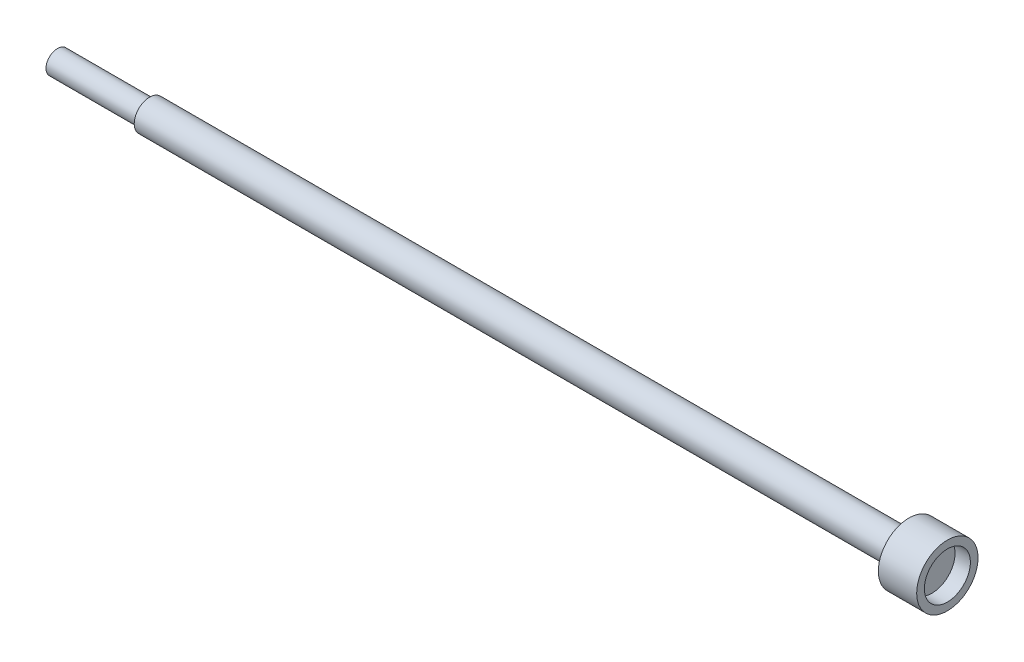
ISO-10303-21;
HEADER;
FILE_DESCRIPTION(('STEP AP214'),'2;1');
FILE_NAME('part.step','',(''),(''),'','','');
FILE_SCHEMA(('AUTOMOTIVE_DESIGN { 1 0 10303 214 1 1 1 1 }'));
ENDSEC;
DATA;
#1=APPLICATION_CONTEXT('core data for automotive mechanical design processes');
#2=APPLICATION_PROTOCOL_DEFINITION('international standard','automotive_design',2000,#1);
#3=PRODUCT_CONTEXT('',#1,'mechanical');
#4=PRODUCT('Part','Part','',(#3));
#5=PRODUCT_RELATED_PRODUCT_CATEGORY('part','',(#4));
#6=PRODUCT_DEFINITION_FORMATION('','',#4);
#7=PRODUCT_DEFINITION_CONTEXT('part definition',#1,'design');
#8=PRODUCT_DEFINITION('design','',#6,#7);
#9=PRODUCT_DEFINITION_SHAPE('','',#8);
#10=(LENGTH_UNIT() NAMED_UNIT(*) SI_UNIT(.MILLI.,.METRE.));
#11=(NAMED_UNIT(*) PLANE_ANGLE_UNIT() SI_UNIT($,.RADIAN.));
#12=(NAMED_UNIT(*) SI_UNIT($,.STERADIAN.) SOLID_ANGLE_UNIT());
#13=UNCERTAINTY_MEASURE_WITH_UNIT(LENGTH_MEASURE(1.E-05),#10,'distance_accuracy_value','');
#14=(GEOMETRIC_REPRESENTATION_CONTEXT(3) GLOBAL_UNCERTAINTY_ASSIGNED_CONTEXT((#13)) GLOBAL_UNIT_ASSIGNED_CONTEXT((#10,
#11,#12)) REPRESENTATION_CONTEXT('',''));
#15=CARTESIAN_POINT('',(0.,0.,0.));
#16=DIRECTION('',(0.,0.,1.));
#17=DIRECTION('',(1.,0.,0.));
#18=AXIS2_PLACEMENT_3D('',#15,#16,#17);
#19=CARTESIAN_POINT('',(0.,0.,0.));
#20=DIRECTION('',(1.,0.,0.));
#21=DIRECTION('',(0.,0.,-1.));
#22=AXIS2_PLACEMENT_3D('',#19,#20,#21);
#23=PLANE('',#22);
#24=CARTESIAN_POINT('',(0.,0.,0.));
#25=DIRECTION('',(-1.,0.,0.));
#26=DIRECTION('',(0.,0.,1.));
#27=AXIS2_PLACEMENT_3D('',#24,#25,#26);
#28=CIRCLE('',#27,19.05);
#29=CARTESIAN_POINT('',(0.,0.,19.05));
#30=VERTEX_POINT('',#29);
#31=EDGE_CURVE('E73',#30,#30,#28,.T.);
#32=ORIENTED_EDGE('',*,*,#31,.F.);
#33=EDGE_LOOP('',(#32));
#34=FACE_BOUND('',#33,.T.);
#35=ADVANCED_FACE('F41',(#34),#23,.T.);
#36=CARTESIAN_POINT('',(-723.9,0.,0.));
#37=DIRECTION('',(-1.,0.,0.));
#38=DIRECTION('',(0.,0.,1.));
#39=AXIS2_PLACEMENT_3D('',#36,#37,#38);
#40=CYLINDRICAL_SURFACE('',#39,19.05);
#41=ORIENTED_EDGE('',*,*,#31,.T.);
#42=EDGE_LOOP('',(#41));
#43=FACE_BOUND('',#42,.T.);
#44=CARTESIAN_POINT('',(12.7,0.,0.));
#45=DIRECTION('',(-1.,0.,0.));
#46=DIRECTION('',(0.,0.,1.));
#47=AXIS2_PLACEMENT_3D('',#44,#45,#46);
#48=CIRCLE('',#47,19.05);
#49=CARTESIAN_POINT('',(12.7,0.,19.05));
#50=VERTEX_POINT('',#49);
#51=EDGE_CURVE('E100',#50,#50,#48,.T.);
#52=ORIENTED_EDGE('',*,*,#51,.F.);
#53=EDGE_LOOP('',(#52));
#54=FACE_BOUND('',#53,.T.);
#55=ADVANCED_FACE('F107',(#43,#54),#40,.F.);
#56=CARTESIAN_POINT('',(12.7,0.,0.));
#57=DIRECTION('',(1.,0.,0.));
#58=DIRECTION('',(0.,0.,-1.));
#59=AXIS2_PLACEMENT_3D('',#56,#57,#58);
#60=PLANE('',#59);
#61=ORIENTED_EDGE('',*,*,#51,.T.);
#62=EDGE_LOOP('',(#61));
#63=FACE_BOUND('',#62,.T.);
#64=CARTESIAN_POINT('',(12.7,0.,0.));
#65=DIRECTION('',(-1.,0.,0.));
#66=DIRECTION('',(0.,0.,1.));
#67=AXIS2_PLACEMENT_3D('',#64,#65,#66);
#68=CIRCLE('',#67,25.4);
#69=CARTESIAN_POINT('',(12.7,0.,25.4));
#70=VERTEX_POINT('',#69);
#71=EDGE_CURVE('E97',#70,#70,#68,.T.);
#72=ORIENTED_EDGE('',*,*,#71,.F.);
#73=EDGE_LOOP('',(#72));
#74=FACE_BOUND('',#73,.T.);
#75=ADVANCED_FACE('F114',(#63,#74),#60,.T.);
#76=CARTESIAN_POINT('',(-723.9,0.,0.));
#77=DIRECTION('',(-1.,0.,0.));
#78=DIRECTION('',(0.,0.,1.));
#79=AXIS2_PLACEMENT_3D('',#76,#77,#78);
#80=CYLINDRICAL_SURFACE('',#79,25.4);
#81=ORIENTED_EDGE('',*,*,#71,.T.);
#82=EDGE_LOOP('',(#81));
#83=FACE_BOUND('',#82,.T.);
#84=CARTESIAN_POINT('',(-19.05,0.,0.));
#85=DIRECTION('',(-1.,0.,0.));
#86=DIRECTION('',(0.,0.,1.));
#87=AXIS2_PLACEMENT_3D('',#84,#85,#86);
#88=CIRCLE('',#87,25.4);
#89=CARTESIAN_POINT('',(-19.05,0.,25.4));
#90=VERTEX_POINT('',#89);
#91=EDGE_CURVE('E94',#90,#90,#88,.T.);
#92=ORIENTED_EDGE('',*,*,#91,.F.);
#93=EDGE_LOOP('',(#92));
#94=FACE_BOUND('',#93,.T.);
#95=ADVANCED_FACE('F118',(#83,#94),#80,.T.);
#96=CARTESIAN_POINT('',(-19.05,0.,0.));
#97=DIRECTION('',(-1.,0.,0.));
#98=DIRECTION('',(0.,0.,1.));
#99=AXIS2_PLACEMENT_3D('',#96,#97,#98);
#100=PLANE('',#99);
#101=ORIENTED_EDGE('',*,*,#91,.T.);
#102=EDGE_LOOP('',(#101));
#103=FACE_BOUND('',#102,.T.);
#104=CARTESIAN_POINT('',(-19.05,0.,0.));
#105=DIRECTION('',(-1.,0.,0.));
#106=DIRECTION('',(0.,0.,1.));
#107=AXIS2_PLACEMENT_3D('',#104,#105,#106);
#108=CIRCLE('',#107,12.7);
#109=CARTESIAN_POINT('',(-19.05,0.,12.7));
#110=VERTEX_POINT('',#109);
#111=EDGE_CURVE('E91',#110,#110,#108,.T.);
#112=ORIENTED_EDGE('',*,*,#111,.F.);
#113=EDGE_LOOP('',(#112));
#114=FACE_BOUND('',#113,.T.);
#115=ADVANCED_FACE('F124',(#103,#114),#100,.T.);
#116=CARTESIAN_POINT('',(-723.9,0.,0.));
#117=DIRECTION('',(-1.,0.,0.));
#118=DIRECTION('',(0.,0.,1.));
#119=AXIS2_PLACEMENT_3D('',#116,#117,#118);
#120=CYLINDRICAL_SURFACE('',#119,12.7);
#121=CARTESIAN_POINT('',(-424.18,0.,0.));
#122=DIRECTION('',(-1.,0.,0.));
#123=DIRECTION('',(0.,0.,1.));
#124=AXIS2_PLACEMENT_3D('',#121,#122,#123);
#125=CIRCLE('',#124,12.7);
#126=CARTESIAN_POINT('',(-424.18,-8.4002604126299,-9.52500000000016));
#127=VERTEX_POINT('',#126);
#128=CARTESIAN_POINT('',(-424.18,8.4002604126299,-9.52500000000016));
#129=VERTEX_POINT('',#128);
#130=EDGE_CURVE('E68',#127,#129,#125,.F.);
#131=ORIENTED_EDGE('',*,*,#130,.F.);
#132=DIRECTION('',(-1.,0.,0.));
#133=VECTOR('',#132,1.);
#134=CARTESIAN_POINT('',(-723.9,-8.4002604126299,-9.52500000000016));
#135=LINE('',#134,#133);
#136=CARTESIAN_POINT('',(-398.78,-8.4002604126299,-9.52500000000016));
#137=VERTEX_POINT('',#136);
#138=EDGE_CURVE('E11',#137,#127,#135,.T.);
#139=ORIENTED_EDGE('',*,*,#138,.F.);
#140=CARTESIAN_POINT('',(-398.78,0.,0.));
#141=DIRECTION('',(1.,0.,0.));
#142=DIRECTION('',(0.,0.,-1.));
#143=AXIS2_PLACEMENT_3D('',#140,#141,#142);
#144=CIRCLE('',#143,12.7);
#145=CARTESIAN_POINT('',(-398.78,8.4002604126299,-9.52500000000016));
#146=VERTEX_POINT('',#145);
#147=EDGE_CURVE('E48',#146,#137,#144,.F.);
#148=ORIENTED_EDGE('',*,*,#147,.F.);
#149=DIRECTION('',(-1.,0.,0.));
#150=VECTOR('',#149,1.);
#151=CARTESIAN_POINT('',(-723.9,8.4002604126299,-9.52500000000016));
#152=LINE('',#151,#150);
#153=EDGE_CURVE('E55',#129,#146,#152,.F.);
#154=ORIENTED_EDGE('',*,*,#153,.F.);
#155=EDGE_LOOP('',(#131,#139,#148,#154));
#156=FACE_BOUND('',#155,.T.);
#157=ORIENTED_EDGE('',*,*,#111,.T.);
#158=EDGE_LOOP('',(#157));
#159=FACE_BOUND('',#158,.T.);
#160=CARTESIAN_POINT('',(-647.7,0.,0.));
#161=DIRECTION('',(-1.,0.,0.));
#162=DIRECTION('',(0.,0.,1.));
#163=AXIS2_PLACEMENT_3D('',#160,#161,#162);
#164=CIRCLE('',#163,12.7);
#165=CARTESIAN_POINT('',(-647.7,0.,12.7));
#166=VERTEX_POINT('',#165);
#167=EDGE_CURVE('E88',#166,#166,#164,.T.);
#168=ORIENTED_EDGE('',*,*,#167,.F.);
#169=EDGE_LOOP('',(#168));
#170=FACE_BOUND('',#169,.T.);
#171=ADVANCED_FACE('F69',(#156,#159,#170),#120,.T.);
#172=CARTESIAN_POINT('',(-647.7,0.,0.));
#173=DIRECTION('',(-1.,0.,0.));
#174=DIRECTION('',(0.,0.,1.));
#175=AXIS2_PLACEMENT_3D('',#172,#173,#174);
#176=PLANE('',#175);
#177=ORIENTED_EDGE('',*,*,#167,.T.);
#178=EDGE_LOOP('',(#177));
#179=FACE_BOUND('',#178,.T.);
#180=CARTESIAN_POINT('',(-647.7,0.,0.));
#181=DIRECTION('',(-1.,0.,0.));
#182=DIRECTION('',(0.,0.,1.));
#183=AXIS2_PLACEMENT_3D('',#180,#181,#182);
#184=CIRCLE('',#183,9.525);
#185=CARTESIAN_POINT('',(-647.7,0.,9.525));
#186=VERTEX_POINT('',#185);
#187=EDGE_CURVE('E85',#186,#186,#184,.T.);
#188=ORIENTED_EDGE('',*,*,#187,.F.);
#189=EDGE_LOOP('',(#188));
#190=FACE_BOUND('',#189,.T.);
#191=ADVANCED_FACE('F131',(#179,#190),#176,.T.);
#192=CARTESIAN_POINT('',(-723.9,0.,0.));
#193=DIRECTION('',(-1.,0.,0.));
#194=DIRECTION('',(0.,0.,1.));
#195=AXIS2_PLACEMENT_3D('',#192,#193,#194);
#196=CYLINDRICAL_SURFACE('',#195,9.525);
#197=ORIENTED_EDGE('',*,*,#187,.T.);
#198=EDGE_LOOP('',(#197));
#199=FACE_BOUND('',#198,.T.);
#200=CARTESIAN_POINT('',(-723.9,0.,0.));
#201=DIRECTION('',(-1.,0.,0.));
#202=DIRECTION('',(0.,0.,1.));
#203=AXIS2_PLACEMENT_3D('',#200,#201,#202);
#204=CIRCLE('',#203,9.525);
#205=CARTESIAN_POINT('',(-723.9,0.,9.525));
#206=VERTEX_POINT('',#205);
#207=EDGE_CURVE('E80',#206,#206,#204,.T.);
#208=ORIENTED_EDGE('',*,*,#207,.F.);
#209=EDGE_LOOP('',(#208));
#210=FACE_BOUND('',#209,.T.);
#211=ADVANCED_FACE('F134',(#199,#210),#196,.T.);
#212=CARTESIAN_POINT('',(-723.9,0.,0.));
#213=DIRECTION('',(-1.,0.,0.));
#214=DIRECTION('',(0.,0.,1.));
#215=AXIS2_PLACEMENT_3D('',#212,#213,#214);
#216=PLANE('',#215);
#217=ORIENTED_EDGE('',*,*,#207,.T.);
#218=EDGE_LOOP('',(#217));
#219=FACE_BOUND('',#218,.T.);
#220=ADVANCED_FACE('F138',(#219),#216,.T.);
#221=CARTESIAN_POINT('',(-398.78,-25.4,-9.52500000000016));
#222=DIRECTION('',(1.,0.,0.));
#223=DIRECTION('',(0.,0.,-1.));
#224=AXIS2_PLACEMENT_3D('',#221,#222,#223);
#225=PLANE('',#224);
#226=ORIENTED_EDGE('',*,*,#147,.T.);
#227=DIRECTION('',(0.,1.,0.));
#228=VECTOR('',#227,1.);
#229=CARTESIAN_POINT('',(-398.78,-25.4,-9.52500000000016));
#230=LINE('',#229,#228);
#231=EDGE_CURVE('E77',#137,#146,#230,.T.);
#232=ORIENTED_EDGE('',*,*,#231,.T.);
#233=EDGE_LOOP('',(#226,#232));
#234=FACE_BOUND('',#233,.T.);
#235=ADVANCED_FACE('F142',(#234),#225,.F.);
#236=CARTESIAN_POINT('',(-424.18,-25.4,-9.52500000000016));
#237=DIRECTION('',(0.,0.,1.));
#238=DIRECTION('',(1.,0.,0.));
#239=AXIS2_PLACEMENT_3D('',#236,#237,#238);
#240=PLANE('',#239);
#241=ORIENTED_EDGE('',*,*,#153,.T.);
#242=ORIENTED_EDGE('',*,*,#231,.F.);
#243=ORIENTED_EDGE('',*,*,#138,.T.);
#244=DIRECTION('',(0.,1.,0.));
#245=VECTOR('',#244,1.);
#246=CARTESIAN_POINT('',(-424.18,-25.4,-9.52500000000016));
#247=LINE('',#246,#245);
#248=EDGE_CURVE('E76',#127,#129,#247,.T.);
#249=ORIENTED_EDGE('',*,*,#248,.T.);
#250=EDGE_LOOP('',(#241,#242,#243,#249));
#251=FACE_BOUND('',#250,.T.);
#252=ADVANCED_FACE('F75',(#251),#240,.F.);
#253=CARTESIAN_POINT('',(-424.18,-25.4,-9.52500000000016));
#254=DIRECTION('',(-1.,0.,0.));
#255=DIRECTION('',(0.,0.,1.));
#256=AXIS2_PLACEMENT_3D('',#253,#254,#255);
#257=PLANE('',#256);
#258=ORIENTED_EDGE('',*,*,#248,.F.);
#259=ORIENTED_EDGE('',*,*,#130,.T.);
#260=EDGE_LOOP('',(#258,#259));
#261=FACE_BOUND('',#260,.T.);
#262=ADVANCED_FACE('F78',(#261),#257,.F.);
#263=CLOSED_SHELL('',(#35,#55,#75,#95,#115,#171,#191,#211,#220,#235,#252,#262));
#264=MANIFOLD_SOLID_BREP('B2',#263);
#265=ADVANCED_BREP_SHAPE_REPRESENTATION('',(#18,#264),#14);
#266=SHAPE_DEFINITION_REPRESENTATION(#9,#265);
ENDSEC;
END-ISO-10303-21;
